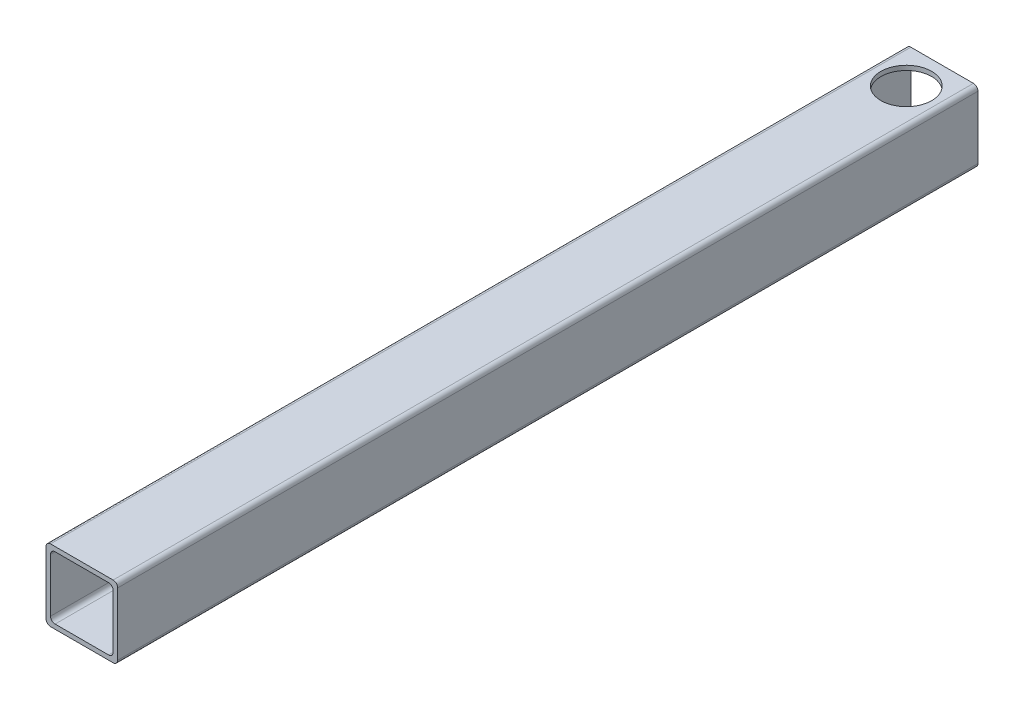
ISO-10303-21;
HEADER;
FILE_DESCRIPTION(('STEP AP214'),'2;1');
FILE_NAME('part.step','',(''),(''),'','','');
FILE_SCHEMA(('AUTOMOTIVE_DESIGN { 1 0 10303 214 1 1 1 1 }'));
ENDSEC;
DATA;
#1=APPLICATION_CONTEXT('core data for automotive mechanical design processes');
#2=APPLICATION_PROTOCOL_DEFINITION('international standard','automotive_design',2000,#1);
#3=PRODUCT_CONTEXT('',#1,'mechanical');
#4=PRODUCT('Part','Part','',(#3));
#5=PRODUCT_RELATED_PRODUCT_CATEGORY('part','',(#4));
#6=PRODUCT_DEFINITION_FORMATION('','',#4);
#7=PRODUCT_DEFINITION_CONTEXT('part definition',#1,'design');
#8=PRODUCT_DEFINITION('design','',#6,#7);
#9=PRODUCT_DEFINITION_SHAPE('','',#8);
#10=(LENGTH_UNIT() NAMED_UNIT(*) SI_UNIT(.MILLI.,.METRE.));
#11=(NAMED_UNIT(*) PLANE_ANGLE_UNIT() SI_UNIT($,.RADIAN.));
#12=(NAMED_UNIT(*) SI_UNIT($,.STERADIAN.) SOLID_ANGLE_UNIT());
#13=UNCERTAINTY_MEASURE_WITH_UNIT(LENGTH_MEASURE(1.E-05),#10,'distance_accuracy_value','');
#14=(GEOMETRIC_REPRESENTATION_CONTEXT(3) GLOBAL_UNCERTAINTY_ASSIGNED_CONTEXT((#13)) GLOBAL_UNIT_ASSIGNED_CONTEXT((#10,
#11,#12)) REPRESENTATION_CONTEXT('',''));
#15=CARTESIAN_POINT('',(0.,0.,0.));
#16=DIRECTION('',(0.,0.,1.));
#17=DIRECTION('',(1.,0.,0.));
#18=AXIS2_PLACEMENT_3D('',#15,#16,#17);
#19=CARTESIAN_POINT('',(16.637,16.637,457.2));
#20=DIRECTION('',(0.,0.,1.));
#21=DIRECTION('',(1.,0.,0.));
#22=AXIS2_PLACEMENT_3D('',#19,#20,#21);
#23=PLANE('',#22);
#24=CARTESIAN_POINT('',(16.637,16.637,457.2));
#25=DIRECTION('',(0.,0.,1.));
#26=DIRECTION('',(1.,0.,0.));
#27=AXIS2_PLACEMENT_3D('',#24,#25,#26);
#28=CIRCLE('',#27,2.413);
#29=CARTESIAN_POINT('',(19.05,16.637,457.2));
#30=VERTEX_POINT('',#29);
#31=CARTESIAN_POINT('',(16.637,19.05,457.2));
#32=VERTEX_POINT('',#31);
#33=EDGE_CURVE('E228',#30,#32,#28,.T.);
#34=ORIENTED_EDGE('',*,*,#33,.T.);
#35=DIRECTION('',(-1.,0.,0.));
#36=VECTOR('',#35,1.);
#37=CARTESIAN_POINT('',(16.637,19.05,457.2));
#38=LINE('',#37,#36);
#39=CARTESIAN_POINT('',(-16.637,19.05,457.2));
#40=VERTEX_POINT('',#39);
#41=EDGE_CURVE('E231',#32,#40,#38,.T.);
#42=ORIENTED_EDGE('',*,*,#41,.T.);
#43=CARTESIAN_POINT('',(-16.637,16.637,457.2));
#44=DIRECTION('',(0.,0.,1.));
#45=DIRECTION('',(1.,0.,0.));
#46=AXIS2_PLACEMENT_3D('',#43,#44,#45);
#47=CIRCLE('',#46,2.413);
#48=CARTESIAN_POINT('',(-19.05,16.637,457.2));
#49=VERTEX_POINT('',#48);
#50=EDGE_CURVE('E234',#40,#49,#47,.T.);
#51=ORIENTED_EDGE('',*,*,#50,.T.);
#52=DIRECTION('',(0.,-1.,0.));
#53=VECTOR('',#52,1.);
#54=CARTESIAN_POINT('',(-19.05,-16.637,457.2));
#55=LINE('',#54,#53);
#56=CARTESIAN_POINT('',(-19.05,-16.637,457.2));
#57=VERTEX_POINT('',#56);
#58=EDGE_CURVE('E236',#49,#57,#55,.T.);
#59=ORIENTED_EDGE('',*,*,#58,.T.);
#60=CARTESIAN_POINT('',(-16.637,-16.637,457.2));
#61=DIRECTION('',(0.,0.,1.));
#62=DIRECTION('',(1.,0.,0.));
#63=AXIS2_PLACEMENT_3D('',#60,#61,#62);
#64=CIRCLE('',#63,2.413);
#65=CARTESIAN_POINT('',(-16.637,-19.05,457.2));
#66=VERTEX_POINT('',#65);
#67=EDGE_CURVE('E238',#57,#66,#64,.T.);
#68=ORIENTED_EDGE('',*,*,#67,.T.);
#69=DIRECTION('',(1.,0.,0.));
#70=VECTOR('',#69,1.);
#71=CARTESIAN_POINT('',(-16.637,-19.05,457.2));
#72=LINE('',#71,#70);
#73=CARTESIAN_POINT('',(16.637,-19.05,457.2));
#74=VERTEX_POINT('',#73);
#75=EDGE_CURVE('E240',#66,#74,#72,.T.);
#76=ORIENTED_EDGE('',*,*,#75,.T.);
#77=CARTESIAN_POINT('',(16.637,-16.637,457.2));
#78=DIRECTION('',(0.,0.,1.));
#79=DIRECTION('',(1.,0.,0.));
#80=AXIS2_PLACEMENT_3D('',#77,#78,#79);
#81=CIRCLE('',#80,2.413);
#82=CARTESIAN_POINT('',(19.05,-16.637,457.2));
#83=VERTEX_POINT('',#82);
#84=EDGE_CURVE('E242',#74,#83,#81,.T.);
#85=ORIENTED_EDGE('',*,*,#84,.T.);
#86=DIRECTION('',(0.,1.,0.));
#87=VECTOR('',#86,1.);
#88=CARTESIAN_POINT('',(19.05,16.637,457.2));
#89=LINE('',#88,#87);
#90=EDGE_CURVE('E244',#83,#30,#89,.T.);
#91=ORIENTED_EDGE('',*,*,#90,.T.);
#92=EDGE_LOOP('',(#34,#42,#51,#59,#68,#76,#85,#91));
#93=FACE_BOUND('',#92,.T.);
#94=DIRECTION('',(0.,-1.,0.));
#95=VECTOR('',#94,1.);
#96=CARTESIAN_POINT('',(-16.637,-14.224,457.2));
#97=LINE('',#96,#95);
#98=CARTESIAN_POINT('',(-16.637,14.224,457.2));
#99=VERTEX_POINT('',#98);
#100=CARTESIAN_POINT('',(-16.637,-14.224,457.2));
#101=VERTEX_POINT('',#100);
#102=EDGE_CURVE('E161',#99,#101,#97,.T.);
#103=ORIENTED_EDGE('',*,*,#102,.F.);
#104=CARTESIAN_POINT('',(-14.224,14.224,457.2));
#105=DIRECTION('',(0.,0.,1.));
#106=DIRECTION('',(1.,0.,0.));
#107=AXIS2_PLACEMENT_3D('',#104,#105,#106);
#108=CIRCLE('',#107,2.41299999999999);
#109=CARTESIAN_POINT('',(-14.224,16.637,457.2));
#110=VERTEX_POINT('',#109);
#111=EDGE_CURVE('E153',#110,#99,#108,.T.);
#112=ORIENTED_EDGE('',*,*,#111,.F.);
#113=DIRECTION('',(-1.,0.,0.));
#114=VECTOR('',#113,1.);
#115=CARTESIAN_POINT('',(14.224,16.637,457.2));
#116=LINE('',#115,#114);
#117=CARTESIAN_POINT('',(14.224,16.637,457.2));
#118=VERTEX_POINT('',#117);
#119=EDGE_CURVE('E188',#118,#110,#116,.T.);
#120=ORIENTED_EDGE('',*,*,#119,.F.);
#121=CARTESIAN_POINT('',(14.224,14.224,457.2));
#122=DIRECTION('',(0.,0.,1.));
#123=DIRECTION('',(1.,0.,0.));
#124=AXIS2_PLACEMENT_3D('',#121,#122,#123);
#125=CIRCLE('',#124,2.41299999999999);
#126=CARTESIAN_POINT('',(16.637,14.224,457.2));
#127=VERTEX_POINT('',#126);
#128=EDGE_CURVE('E186',#127,#118,#125,.T.);
#129=ORIENTED_EDGE('',*,*,#128,.F.);
#130=DIRECTION('',(0.,1.,0.));
#131=VECTOR('',#130,1.);
#132=CARTESIAN_POINT('',(16.637,14.224,457.2));
#133=LINE('',#132,#131);
#134=CARTESIAN_POINT('',(16.637,-14.224,457.2));
#135=VERTEX_POINT('',#134);
#136=EDGE_CURVE('E184',#135,#127,#133,.T.);
#137=ORIENTED_EDGE('',*,*,#136,.F.);
#138=CARTESIAN_POINT('',(14.224,-14.224,457.2));
#139=DIRECTION('',(0.,0.,1.));
#140=DIRECTION('',(1.,0.,0.));
#141=AXIS2_PLACEMENT_3D('',#138,#139,#140);
#142=CIRCLE('',#141,2.41299999999999);
#143=CARTESIAN_POINT('',(14.224,-16.637,457.2));
#144=VERTEX_POINT('',#143);
#145=EDGE_CURVE('E182',#144,#135,#142,.T.);
#146=ORIENTED_EDGE('',*,*,#145,.F.);
#147=DIRECTION('',(1.,0.,0.));
#148=VECTOR('',#147,1.);
#149=CARTESIAN_POINT('',(-14.224,-16.637,457.2));
#150=LINE('',#149,#148);
#151=CARTESIAN_POINT('',(-14.224,-16.637,457.2));
#152=VERTEX_POINT('',#151);
#153=EDGE_CURVE('E177',#152,#144,#150,.T.);
#154=ORIENTED_EDGE('',*,*,#153,.F.);
#155=CARTESIAN_POINT('',(-14.224,-14.224,457.2));
#156=DIRECTION('',(0.,0.,1.));
#157=DIRECTION('',(1.,0.,0.));
#158=AXIS2_PLACEMENT_3D('',#155,#156,#157);
#159=CIRCLE('',#158,2.41299999999999);
#160=EDGE_CURVE('E175',#101,#152,#159,.T.);
#161=ORIENTED_EDGE('',*,*,#160,.F.);
#162=EDGE_LOOP('',(#103,#112,#120,#129,#137,#146,#154,#161));
#163=FACE_BOUND('',#162,.T.);
#164=ADVANCED_FACE('F38',(#93,#163),#23,.T.);
#165=CARTESIAN_POINT('',(16.637,16.637,0.));
#166=DIRECTION('',(0.,0.,1.));
#167=DIRECTION('',(1.,0.,0.));
#168=AXIS2_PLACEMENT_3D('',#165,#166,#167);
#169=PLANE('',#168);
#170=CARTESIAN_POINT('',(16.637,16.637,0.));
#171=DIRECTION('',(0.,0.,1.));
#172=DIRECTION('',(1.,0.,0.));
#173=AXIS2_PLACEMENT_3D('',#170,#171,#172);
#174=CIRCLE('',#173,2.413);
#175=CARTESIAN_POINT('',(19.05,16.637,0.));
#176=VERTEX_POINT('',#175);
#177=CARTESIAN_POINT('',(16.637,19.05,0.));
#178=VERTEX_POINT('',#177);
#179=EDGE_CURVE('E170',#176,#178,#174,.T.);
#180=ORIENTED_EDGE('',*,*,#179,.F.);
#181=DIRECTION('',(0.,1.,0.));
#182=VECTOR('',#181,1.);
#183=CARTESIAN_POINT('',(19.05,16.637,0.));
#184=LINE('',#183,#182);
#185=CARTESIAN_POINT('',(19.05,-16.637,0.));
#186=VERTEX_POINT('',#185);
#187=EDGE_CURVE('E232',#186,#176,#184,.T.);
#188=ORIENTED_EDGE('',*,*,#187,.F.);
#189=CARTESIAN_POINT('',(16.637,-16.637,0.));
#190=DIRECTION('',(0.,0.,1.));
#191=DIRECTION('',(1.,0.,0.));
#192=AXIS2_PLACEMENT_3D('',#189,#190,#191);
#193=CIRCLE('',#192,2.413);
#194=CARTESIAN_POINT('',(16.637,-19.05,0.));
#195=VERTEX_POINT('',#194);
#196=EDGE_CURVE('E259',#195,#186,#193,.T.);
#197=ORIENTED_EDGE('',*,*,#196,.F.);
#198=DIRECTION('',(1.,0.,0.));
#199=VECTOR('',#198,1.);
#200=CARTESIAN_POINT('',(-16.637,-19.05,0.));
#201=LINE('',#200,#199);
#202=CARTESIAN_POINT('',(-16.637,-19.05,0.));
#203=VERTEX_POINT('',#202);
#204=EDGE_CURVE('E257',#203,#195,#201,.T.);
#205=ORIENTED_EDGE('',*,*,#204,.F.);
#206=CARTESIAN_POINT('',(-16.637,-16.637,0.));
#207=DIRECTION('',(0.,0.,1.));
#208=DIRECTION('',(1.,0.,0.));
#209=AXIS2_PLACEMENT_3D('',#206,#207,#208);
#210=CIRCLE('',#209,2.413);
#211=CARTESIAN_POINT('',(-19.05,-16.637,0.));
#212=VERTEX_POINT('',#211);
#213=EDGE_CURVE('E255',#212,#203,#210,.T.);
#214=ORIENTED_EDGE('',*,*,#213,.F.);
#215=DIRECTION('',(0.,-1.,0.));
#216=VECTOR('',#215,1.);
#217=CARTESIAN_POINT('',(-19.05,-16.637,0.));
#218=LINE('',#217,#216);
#219=CARTESIAN_POINT('',(-19.05,16.637,0.));
#220=VERTEX_POINT('',#219);
#221=EDGE_CURVE('E253',#220,#212,#218,.T.);
#222=ORIENTED_EDGE('',*,*,#221,.F.);
#223=CARTESIAN_POINT('',(-16.637,16.637,0.));
#224=DIRECTION('',(0.,0.,1.));
#225=DIRECTION('',(1.,0.,0.));
#226=AXIS2_PLACEMENT_3D('',#223,#224,#225);
#227=CIRCLE('',#226,2.413);
#228=CARTESIAN_POINT('',(-16.637,19.05,0.));
#229=VERTEX_POINT('',#228);
#230=EDGE_CURVE('E251',#229,#220,#227,.T.);
#231=ORIENTED_EDGE('',*,*,#230,.F.);
#232=DIRECTION('',(-1.,0.,0.));
#233=VECTOR('',#232,1.);
#234=CARTESIAN_POINT('',(16.637,19.05,0.));
#235=LINE('',#234,#233);
#236=EDGE_CURVE('E249',#178,#229,#235,.T.);
#237=ORIENTED_EDGE('',*,*,#236,.F.);
#238=EDGE_LOOP('',(#180,#188,#197,#205,#214,#222,#231,#237));
#239=FACE_BOUND('',#238,.T.);
#240=CARTESIAN_POINT('',(-14.224,14.224,0.));
#241=DIRECTION('',(0.,0.,1.));
#242=DIRECTION('',(1.,0.,0.));
#243=AXIS2_PLACEMENT_3D('',#240,#241,#242);
#244=CIRCLE('',#243,2.41299999999999);
#245=CARTESIAN_POINT('',(-14.224,16.637,0.));
#246=VERTEX_POINT('',#245);
#247=CARTESIAN_POINT('',(-16.637,14.224,0.));
#248=VERTEX_POINT('',#247);
#249=EDGE_CURVE('E63',#246,#248,#244,.T.);
#250=ORIENTED_EDGE('',*,*,#249,.T.);
#251=DIRECTION('',(0.,-1.,0.));
#252=VECTOR('',#251,1.);
#253=CARTESIAN_POINT('',(-16.637,-14.224,0.));
#254=LINE('',#253,#252);
#255=CARTESIAN_POINT('',(-16.637,-14.224,0.));
#256=VERTEX_POINT('',#255);
#257=EDGE_CURVE('E168',#248,#256,#254,.T.);
#258=ORIENTED_EDGE('',*,*,#257,.T.);
#259=CARTESIAN_POINT('',(-14.224,-14.224,0.));
#260=DIRECTION('',(0.,0.,1.));
#261=DIRECTION('',(1.,0.,0.));
#262=AXIS2_PLACEMENT_3D('',#259,#260,#261);
#263=CIRCLE('',#262,2.41299999999999);
#264=CARTESIAN_POINT('',(-14.224,-16.637,0.));
#265=VERTEX_POINT('',#264);
#266=EDGE_CURVE('E193',#256,#265,#263,.T.);
#267=ORIENTED_EDGE('',*,*,#266,.T.);
#268=DIRECTION('',(1.,0.,0.));
#269=VECTOR('',#268,1.);
#270=CARTESIAN_POINT('',(-14.224,-16.637,0.));
#271=LINE('',#270,#269);
#272=CARTESIAN_POINT('',(14.224,-16.637,0.));
#273=VERTEX_POINT('',#272);
#274=EDGE_CURVE('E196',#265,#273,#271,.T.);
#275=ORIENTED_EDGE('',*,*,#274,.T.);
#276=CARTESIAN_POINT('',(14.224,-14.224,0.));
#277=DIRECTION('',(0.,0.,1.));
#278=DIRECTION('',(1.,0.,0.));
#279=AXIS2_PLACEMENT_3D('',#276,#277,#278);
#280=CIRCLE('',#279,2.41299999999999);
#281=CARTESIAN_POINT('',(16.637,-14.224,0.));
#282=VERTEX_POINT('',#281);
#283=EDGE_CURVE('E199',#273,#282,#280,.T.);
#284=ORIENTED_EDGE('',*,*,#283,.T.);
#285=DIRECTION('',(0.,1.,0.));
#286=VECTOR('',#285,1.);
#287=CARTESIAN_POINT('',(16.637,14.224,0.));
#288=LINE('',#287,#286);
#289=CARTESIAN_POINT('',(16.637,14.224,0.));
#290=VERTEX_POINT('',#289);
#291=EDGE_CURVE('E202',#282,#290,#288,.T.);
#292=ORIENTED_EDGE('',*,*,#291,.T.);
#293=CARTESIAN_POINT('',(14.224,14.224,0.));
#294=DIRECTION('',(0.,0.,1.));
#295=DIRECTION('',(1.,0.,0.));
#296=AXIS2_PLACEMENT_3D('',#293,#294,#295);
#297=CIRCLE('',#296,2.41299999999999);
#298=CARTESIAN_POINT('',(14.224,16.637,0.));
#299=VERTEX_POINT('',#298);
#300=EDGE_CURVE('E205',#290,#299,#297,.T.);
#301=ORIENTED_EDGE('',*,*,#300,.T.);
#302=DIRECTION('',(-1.,0.,0.));
#303=VECTOR('',#302,1.);
#304=CARTESIAN_POINT('',(14.224,16.637,0.));
#305=LINE('',#304,#303);
#306=EDGE_CURVE('E162',#299,#246,#305,.T.);
#307=ORIENTED_EDGE('',*,*,#306,.T.);
#308=EDGE_LOOP('',(#250,#258,#267,#275,#284,#292,#301,#307));
#309=FACE_BOUND('',#308,.T.);
#310=ADVANCED_FACE('F297',(#239,#309),#169,.F.);
#311=CARTESIAN_POINT('',(16.637,16.637,457.2));
#312=DIRECTION('',(0.,0.,-1.));
#313=DIRECTION('',(-1.,0.,0.));
#314=AXIS2_PLACEMENT_3D('',#311,#312,#313);
#315=CYLINDRICAL_SURFACE('',#314,2.413);
#316=ORIENTED_EDGE('',*,*,#179,.T.);
#317=DIRECTION('',(0.,0.,-1.));
#318=VECTOR('',#317,1.);
#319=CARTESIAN_POINT('',(16.637,19.05,457.2));
#320=LINE('',#319,#318);
#321=EDGE_CURVE('E11',#32,#178,#320,.T.);
#322=ORIENTED_EDGE('',*,*,#321,.F.);
#323=ORIENTED_EDGE('',*,*,#33,.F.);
#324=DIRECTION('',(0.,0.,-1.));
#325=VECTOR('',#324,1.);
#326=CARTESIAN_POINT('',(19.05,16.637,457.2));
#327=LINE('',#326,#325);
#328=EDGE_CURVE('E246',#30,#176,#327,.T.);
#329=ORIENTED_EDGE('',*,*,#328,.T.);
#330=EDGE_LOOP('',(#316,#322,#323,#329));
#331=FACE_BOUND('',#330,.T.);
#332=ADVANCED_FACE('F40',(#331),#315,.T.);
#333=CARTESIAN_POINT('',(16.637,19.05,457.2));
#334=DIRECTION('',(0.,-1.,0.));
#335=DIRECTION('',(1.,0.,0.));
#336=AXIS2_PLACEMENT_3D('',#333,#334,#335);
#337=PLANE('',#336);
#338=CARTESIAN_POINT('',(0.,19.05,19.05));
#339=DIRECTION('',(0.,-1.,0.));
#340=DIRECTION('',(1.,0.,0.));
#341=AXIS2_PLACEMENT_3D('',#338,#339,#340);
#342=CIRCLE('',#341,13.49375);
#343=CARTESIAN_POINT('',(13.49375,19.05,19.05));
#344=VERTEX_POINT('',#343);
#345=EDGE_CURVE('E191',#344,#344,#342,.T.);
#346=ORIENTED_EDGE('',*,*,#345,.T.);
#347=EDGE_LOOP('',(#346));
#348=FACE_BOUND('',#347,.T.);
#349=ORIENTED_EDGE('',*,*,#236,.T.);
#350=DIRECTION('',(0.,0.,-1.));
#351=VECTOR('',#350,1.);
#352=CARTESIAN_POINT('',(-16.637,19.05,457.2));
#353=LINE('',#352,#351);
#354=EDGE_CURVE('E48',#40,#229,#353,.T.);
#355=ORIENTED_EDGE('',*,*,#354,.F.);
#356=ORIENTED_EDGE('',*,*,#41,.F.);
#357=ORIENTED_EDGE('',*,*,#321,.T.);
#358=EDGE_LOOP('',(#349,#355,#356,#357));
#359=FACE_BOUND('',#358,.T.);
#360=ADVANCED_FACE('F314',(#348,#359),#337,.F.);
#361=CARTESIAN_POINT('',(-16.637,16.637,457.2));
#362=DIRECTION('',(0.,0.,-1.));
#363=DIRECTION('',(-1.,0.,0.));
#364=AXIS2_PLACEMENT_3D('',#361,#362,#363);
#365=CYLINDRICAL_SURFACE('',#364,2.413);
#366=ORIENTED_EDGE('',*,*,#230,.T.);
#367=DIRECTION('',(0.,0.,-1.));
#368=VECTOR('',#367,1.);
#369=CARTESIAN_POINT('',(-19.05,16.637,457.2));
#370=LINE('',#369,#368);
#371=EDGE_CURVE('E281',#49,#220,#370,.T.);
#372=ORIENTED_EDGE('',*,*,#371,.F.);
#373=ORIENTED_EDGE('',*,*,#50,.F.);
#374=ORIENTED_EDGE('',*,*,#354,.T.);
#375=EDGE_LOOP('',(#366,#372,#373,#374));
#376=FACE_BOUND('',#375,.T.);
#377=ADVANCED_FACE('F291',(#376),#365,.T.);
#378=CARTESIAN_POINT('',(-19.05,-16.637,457.2));
#379=DIRECTION('',(1.,0.,0.));
#380=DIRECTION('',(0.,1.,0.));
#381=AXIS2_PLACEMENT_3D('',#378,#379,#380);
#382=PLANE('',#381);
#383=ORIENTED_EDGE('',*,*,#221,.T.);
#384=DIRECTION('',(0.,0.,-1.));
#385=VECTOR('',#384,1.);
#386=CARTESIAN_POINT('',(-19.05,-16.637,457.2));
#387=LINE('',#386,#385);
#388=EDGE_CURVE('E277',#57,#212,#387,.T.);
#389=ORIENTED_EDGE('',*,*,#388,.F.);
#390=ORIENTED_EDGE('',*,*,#58,.F.);
#391=ORIENTED_EDGE('',*,*,#371,.T.);
#392=EDGE_LOOP('',(#383,#389,#390,#391));
#393=FACE_BOUND('',#392,.T.);
#394=ADVANCED_FACE('F303',(#393),#382,.F.);
#395=CARTESIAN_POINT('',(-16.637,-16.637,457.2));
#396=DIRECTION('',(0.,0.,-1.));
#397=DIRECTION('',(-1.,0.,0.));
#398=AXIS2_PLACEMENT_3D('',#395,#396,#397);
#399=CYLINDRICAL_SURFACE('',#398,2.413);
#400=ORIENTED_EDGE('',*,*,#213,.T.);
#401=DIRECTION('',(0.,0.,-1.));
#402=VECTOR('',#401,1.);
#403=CARTESIAN_POINT('',(-16.637,-19.05,457.2));
#404=LINE('',#403,#402);
#405=EDGE_CURVE('E273',#66,#203,#404,.T.);
#406=ORIENTED_EDGE('',*,*,#405,.F.);
#407=ORIENTED_EDGE('',*,*,#67,.F.);
#408=ORIENTED_EDGE('',*,*,#388,.T.);
#409=EDGE_LOOP('',(#400,#406,#407,#408));
#410=FACE_BOUND('',#409,.T.);
#411=ADVANCED_FACE('F307',(#410),#399,.T.);
#412=CARTESIAN_POINT('',(-16.637,-19.05,457.2));
#413=DIRECTION('',(0.,1.,0.));
#414=DIRECTION('',(-1.,0.,0.));
#415=AXIS2_PLACEMENT_3D('',#412,#413,#414);
#416=PLANE('',#415);
#417=CARTESIAN_POINT('',(0.,-19.05,19.05));
#418=DIRECTION('',(0.,1.,0.));
#419=DIRECTION('',(-1.,0.,0.));
#420=AXIS2_PLACEMENT_3D('',#417,#418,#419);
#421=CIRCLE('',#420,13.49375);
#422=CARTESIAN_POINT('',(-13.49375,-19.05,19.05));
#423=VERTEX_POINT('',#422);
#424=EDGE_CURVE('E395',#423,#423,#421,.T.);
#425=ORIENTED_EDGE('',*,*,#424,.T.);
#426=EDGE_LOOP('',(#425));
#427=FACE_BOUND('',#426,.T.);
#428=ORIENTED_EDGE('',*,*,#204,.T.);
#429=DIRECTION('',(0.,0.,-1.));
#430=VECTOR('',#429,1.);
#431=CARTESIAN_POINT('',(16.637,-19.05,457.2));
#432=LINE('',#431,#430);
#433=EDGE_CURVE('E269',#74,#195,#432,.T.);
#434=ORIENTED_EDGE('',*,*,#433,.F.);
#435=ORIENTED_EDGE('',*,*,#75,.F.);
#436=ORIENTED_EDGE('',*,*,#405,.T.);
#437=EDGE_LOOP('',(#428,#434,#435,#436));
#438=FACE_BOUND('',#437,.T.);
#439=ADVANCED_FACE('F327',(#427,#438),#416,.F.);
#440=CARTESIAN_POINT('',(16.637,-16.637,457.2));
#441=DIRECTION('',(0.,0.,-1.));
#442=DIRECTION('',(-1.,0.,0.));
#443=AXIS2_PLACEMENT_3D('',#440,#441,#442);
#444=CYLINDRICAL_SURFACE('',#443,2.413);
#445=ORIENTED_EDGE('',*,*,#196,.T.);
#446=DIRECTION('',(0.,0.,-1.));
#447=VECTOR('',#446,1.);
#448=CARTESIAN_POINT('',(19.05,-16.637,457.2));
#449=LINE('',#448,#447);
#450=EDGE_CURVE('E265',#83,#186,#449,.T.);
#451=ORIENTED_EDGE('',*,*,#450,.F.);
#452=ORIENTED_EDGE('',*,*,#84,.F.);
#453=ORIENTED_EDGE('',*,*,#433,.T.);
#454=EDGE_LOOP('',(#445,#451,#452,#453));
#455=FACE_BOUND('',#454,.T.);
#456=ADVANCED_FACE('F325',(#455),#444,.T.);
#457=CARTESIAN_POINT('',(19.05,16.637,457.2));
#458=DIRECTION('',(-1.,0.,0.));
#459=DIRECTION('',(0.,-1.,0.));
#460=AXIS2_PLACEMENT_3D('',#457,#458,#459);
#461=PLANE('',#460);
#462=ORIENTED_EDGE('',*,*,#187,.T.);
#463=ORIENTED_EDGE('',*,*,#328,.F.);
#464=ORIENTED_EDGE('',*,*,#90,.F.);
#465=ORIENTED_EDGE('',*,*,#450,.T.);
#466=EDGE_LOOP('',(#462,#463,#464,#465));
#467=FACE_BOUND('',#466,.T.);
#468=ADVANCED_FACE('F320',(#467),#461,.F.);
#469=CARTESIAN_POINT('',(-14.224,14.224,457.2));
#470=DIRECTION('',(0.,0.,-1.));
#471=DIRECTION('',(-1.,0.,0.));
#472=AXIS2_PLACEMENT_3D('',#469,#470,#471);
#473=CYLINDRICAL_SURFACE('',#472,2.41299999999999);
#474=ORIENTED_EDGE('',*,*,#249,.F.);
#475=DIRECTION('',(0.,0.,-1.));
#476=VECTOR('',#475,1.);
#477=CARTESIAN_POINT('',(-14.224,16.637,457.2));
#478=LINE('',#477,#476);
#479=EDGE_CURVE('E157',#110,#246,#478,.T.);
#480=ORIENTED_EDGE('',*,*,#479,.F.);
#481=ORIENTED_EDGE('',*,*,#111,.T.);
#482=DIRECTION('',(0.,0.,-1.));
#483=VECTOR('',#482,1.);
#484=CARTESIAN_POINT('',(-16.637,14.224,457.2));
#485=LINE('',#484,#483);
#486=EDGE_CURVE('E156',#99,#248,#485,.T.);
#487=ORIENTED_EDGE('',*,*,#486,.T.);
#488=EDGE_LOOP('',(#474,#480,#481,#487));
#489=FACE_BOUND('',#488,.T.);
#490=ADVANCED_FACE('F155',(#489),#473,.F.);
#491=CARTESIAN_POINT('',(-16.637,-14.224,457.2));
#492=DIRECTION('',(1.,0.,0.));
#493=DIRECTION('',(0.,0.,-1.));
#494=AXIS2_PLACEMENT_3D('',#491,#492,#493);
#495=PLANE('',#494);
#496=ORIENTED_EDGE('',*,*,#257,.F.);
#497=ORIENTED_EDGE('',*,*,#486,.F.);
#498=ORIENTED_EDGE('',*,*,#102,.T.);
#499=DIRECTION('',(0.,0.,-1.));
#500=VECTOR('',#499,1.);
#501=CARTESIAN_POINT('',(-16.637,-14.224,457.2));
#502=LINE('',#501,#500);
#503=EDGE_CURVE('E171',#101,#256,#502,.T.);
#504=ORIENTED_EDGE('',*,*,#503,.T.);
#505=EDGE_LOOP('',(#496,#497,#498,#504));
#506=FACE_BOUND('',#505,.T.);
#507=ADVANCED_FACE('F165',(#506),#495,.T.);
#508=CARTESIAN_POINT('',(-14.224,-14.224,457.2));
#509=DIRECTION('',(0.,0.,-1.));
#510=DIRECTION('',(-1.,0.,0.));
#511=AXIS2_PLACEMENT_3D('',#508,#509,#510);
#512=CYLINDRICAL_SURFACE('',#511,2.41299999999999);
#513=ORIENTED_EDGE('',*,*,#266,.F.);
#514=ORIENTED_EDGE('',*,*,#503,.F.);
#515=ORIENTED_EDGE('',*,*,#160,.T.);
#516=DIRECTION('',(0.,0.,-1.));
#517=VECTOR('',#516,1.);
#518=CARTESIAN_POINT('',(-14.224,-16.637,457.2));
#519=LINE('',#518,#517);
#520=EDGE_CURVE('E223',#152,#265,#519,.T.);
#521=ORIENTED_EDGE('',*,*,#520,.T.);
#522=EDGE_LOOP('',(#513,#514,#515,#521));
#523=FACE_BOUND('',#522,.T.);
#524=ADVANCED_FACE('F354',(#523),#512,.F.);
#525=CARTESIAN_POINT('',(-14.224,-16.637,457.2));
#526=DIRECTION('',(0.,1.,0.));
#527=DIRECTION('',(0.,0.,1.));
#528=AXIS2_PLACEMENT_3D('',#525,#526,#527);
#529=PLANE('',#528);
#530=CARTESIAN_POINT('',(0.,-16.637,19.05));
#531=DIRECTION('',(0.,1.,0.));
#532=DIRECTION('',(0.,0.,1.));
#533=AXIS2_PLACEMENT_3D('',#530,#531,#532);
#534=CIRCLE('',#533,13.49375);
#535=CARTESIAN_POINT('',(0.,-16.637,32.54375));
#536=VERTEX_POINT('',#535);
#537=EDGE_CURVE('E396',#536,#536,#534,.T.);
#538=ORIENTED_EDGE('',*,*,#537,.F.);
#539=EDGE_LOOP('',(#538));
#540=FACE_BOUND('',#539,.T.);
#541=ORIENTED_EDGE('',*,*,#274,.F.);
#542=ORIENTED_EDGE('',*,*,#520,.F.);
#543=ORIENTED_EDGE('',*,*,#153,.T.);
#544=DIRECTION('',(0.,0.,-1.));
#545=VECTOR('',#544,1.);
#546=CARTESIAN_POINT('',(14.224,-16.637,457.2));
#547=LINE('',#546,#545);
#548=EDGE_CURVE('E220',#144,#273,#547,.T.);
#549=ORIENTED_EDGE('',*,*,#548,.T.);
#550=EDGE_LOOP('',(#541,#542,#543,#549));
#551=FACE_BOUND('',#550,.T.);
#552=ADVANCED_FACE('F358',(#540,#551),#529,.T.);
#553=CARTESIAN_POINT('',(14.224,-14.224,457.2));
#554=DIRECTION('',(0.,0.,-1.));
#555=DIRECTION('',(-1.,0.,0.));
#556=AXIS2_PLACEMENT_3D('',#553,#554,#555);
#557=CYLINDRICAL_SURFACE('',#556,2.41299999999999);
#558=ORIENTED_EDGE('',*,*,#283,.F.);
#559=ORIENTED_EDGE('',*,*,#548,.F.);
#560=ORIENTED_EDGE('',*,*,#145,.T.);
#561=DIRECTION('',(0.,0.,-1.));
#562=VECTOR('',#561,1.);
#563=CARTESIAN_POINT('',(16.637,-14.224,457.2));
#564=LINE('',#563,#562);
#565=EDGE_CURVE('E217',#135,#282,#564,.T.);
#566=ORIENTED_EDGE('',*,*,#565,.T.);
#567=EDGE_LOOP('',(#558,#559,#560,#566));
#568=FACE_BOUND('',#567,.T.);
#569=ADVANCED_FACE('F364',(#568),#557,.F.);
#570=CARTESIAN_POINT('',(16.637,14.224,457.2));
#571=DIRECTION('',(-1.,0.,0.));
#572=DIRECTION('',(0.,0.,1.));
#573=AXIS2_PLACEMENT_3D('',#570,#571,#572);
#574=PLANE('',#573);
#575=ORIENTED_EDGE('',*,*,#291,.F.);
#576=ORIENTED_EDGE('',*,*,#565,.F.);
#577=ORIENTED_EDGE('',*,*,#136,.T.);
#578=DIRECTION('',(0.,0.,-1.));
#579=VECTOR('',#578,1.);
#580=CARTESIAN_POINT('',(16.637,14.224,457.2));
#581=LINE('',#580,#579);
#582=EDGE_CURVE('E214',#127,#290,#581,.T.);
#583=ORIENTED_EDGE('',*,*,#582,.T.);
#584=EDGE_LOOP('',(#575,#576,#577,#583));
#585=FACE_BOUND('',#584,.T.);
#586=ADVANCED_FACE('F368',(#585),#574,.T.);
#587=CARTESIAN_POINT('',(14.224,14.224,457.2));
#588=DIRECTION('',(0.,0.,-1.));
#589=DIRECTION('',(-1.,0.,0.));
#590=AXIS2_PLACEMENT_3D('',#587,#588,#589);
#591=CYLINDRICAL_SURFACE('',#590,2.41299999999999);
#592=ORIENTED_EDGE('',*,*,#300,.F.);
#593=ORIENTED_EDGE('',*,*,#582,.F.);
#594=ORIENTED_EDGE('',*,*,#128,.T.);
#595=DIRECTION('',(0.,0.,-1.));
#596=VECTOR('',#595,1.);
#597=CARTESIAN_POINT('',(14.224,16.637,457.2));
#598=LINE('',#597,#596);
#599=EDGE_CURVE('E55',#118,#299,#598,.T.);
#600=ORIENTED_EDGE('',*,*,#599,.T.);
#601=EDGE_LOOP('',(#592,#593,#594,#600));
#602=FACE_BOUND('',#601,.T.);
#603=ADVANCED_FACE('F372',(#602),#591,.F.);
#604=CARTESIAN_POINT('',(14.224,16.637,457.2));
#605=DIRECTION('',(0.,-1.,0.));
#606=DIRECTION('',(0.,0.,-1.));
#607=AXIS2_PLACEMENT_3D('',#604,#605,#606);
#608=PLANE('',#607);
#609=CARTESIAN_POINT('',(0.,16.637,19.05));
#610=DIRECTION('',(0.,-1.,0.));
#611=DIRECTION('',(0.,0.,-1.));
#612=AXIS2_PLACEMENT_3D('',#609,#610,#611);
#613=CIRCLE('',#612,13.49375);
#614=CARTESIAN_POINT('',(0.,16.637,5.55625));
#615=VERTEX_POINT('',#614);
#616=EDGE_CURVE('E42',#615,#615,#613,.T.);
#617=ORIENTED_EDGE('',*,*,#616,.F.);
#618=EDGE_LOOP('',(#617));
#619=FACE_BOUND('',#618,.T.);
#620=ORIENTED_EDGE('',*,*,#306,.F.);
#621=ORIENTED_EDGE('',*,*,#599,.F.);
#622=ORIENTED_EDGE('',*,*,#119,.T.);
#623=ORIENTED_EDGE('',*,*,#479,.T.);
#624=EDGE_LOOP('',(#620,#621,#622,#623));
#625=FACE_BOUND('',#624,.T.);
#626=ADVANCED_FACE('F376',(#619,#625),#608,.T.);
#627=CARTESIAN_POINT('',(0.,-228.6,19.05));
#628=DIRECTION('',(0.,1.,0.));
#629=DIRECTION('',(0.,0.,1.));
#630=AXIS2_PLACEMENT_3D('',#627,#628,#629);
#631=CYLINDRICAL_SURFACE('',#630,13.49375);
#632=ORIENTED_EDGE('',*,*,#616,.T.);
#633=EDGE_LOOP('',(#632));
#634=FACE_BOUND('',#633,.T.);
#635=ORIENTED_EDGE('',*,*,#345,.F.);
#636=EDGE_LOOP('',(#635));
#637=FACE_BOUND('',#636,.T.);
#638=ADVANCED_FACE('F380',(#634,#637),#631,.F.);
#639=ORIENTED_EDGE('',*,*,#537,.T.);
#640=EDGE_LOOP('',(#639));
#641=FACE_BOUND('',#640,.T.);
#642=ORIENTED_EDGE('',*,*,#424,.F.);
#643=EDGE_LOOP('',(#642));
#644=FACE_BOUND('',#643,.T.);
#645=ADVANCED_FACE('F383',(#641,#644),#631,.F.);
#646=CLOSED_SHELL('',(#164,#310,#332,#360,#377,#394,#411,#439,#456,#468,#490,#507,#524,#552,
#569,#586,#603,#626,#638,#645));
#647=MANIFOLD_SOLID_BREP('B2',#646);
#648=ADVANCED_BREP_SHAPE_REPRESENTATION('',(#18,#647),#14);
#649=SHAPE_DEFINITION_REPRESENTATION(#9,#648);
ENDSEC;
END-ISO-10303-21;
